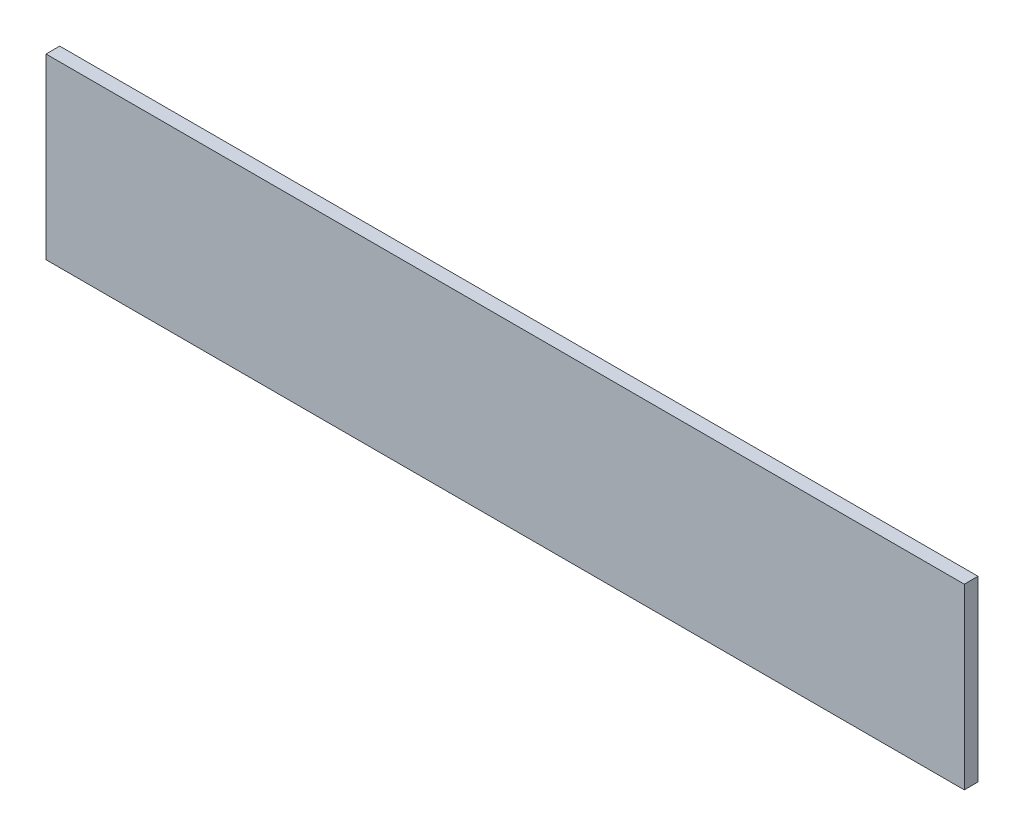
ISO-10303-21;
HEADER;
FILE_DESCRIPTION(('STEP AP214'),'2;1');
FILE_NAME('part.step','',(''),(''),'','','');
FILE_SCHEMA(('AUTOMOTIVE_DESIGN { 1 0 10303 214 1 1 1 1 }'));
ENDSEC;
DATA;
#1=APPLICATION_CONTEXT('core data for automotive mechanical design processes');
#2=APPLICATION_PROTOCOL_DEFINITION('international standard','automotive_design',2000,#1);
#3=PRODUCT_CONTEXT('',#1,'mechanical');
#4=PRODUCT('Part','Part','',(#3));
#5=PRODUCT_RELATED_PRODUCT_CATEGORY('part','',(#4));
#6=PRODUCT_DEFINITION_FORMATION('','',#4);
#7=PRODUCT_DEFINITION_CONTEXT('part definition',#1,'design');
#8=PRODUCT_DEFINITION('design','',#6,#7);
#9=PRODUCT_DEFINITION_SHAPE('','',#8);
#10=(LENGTH_UNIT() NAMED_UNIT(*) SI_UNIT(.MILLI.,.METRE.));
#11=(NAMED_UNIT(*) PLANE_ANGLE_UNIT() SI_UNIT($,.RADIAN.));
#12=(NAMED_UNIT(*) SI_UNIT($,.STERADIAN.) SOLID_ANGLE_UNIT());
#13=UNCERTAINTY_MEASURE_WITH_UNIT(LENGTH_MEASURE(1.E-05),#10,'distance_accuracy_value','');
#14=(GEOMETRIC_REPRESENTATION_CONTEXT(3) GLOBAL_UNCERTAINTY_ASSIGNED_CONTEXT((#13)) GLOBAL_UNIT_ASSIGNED_CONTEXT((#10,
#11,#12)) REPRESENTATION_CONTEXT('',''));
#15=CARTESIAN_POINT('',(0.,0.,0.));
#16=DIRECTION('',(0.,0.,1.));
#17=DIRECTION('',(1.,0.,0.));
#18=AXIS2_PLACEMENT_3D('',#15,#16,#17);
#19=CARTESIAN_POINT('',(33.5,-11.5,4.6));
#20=DIRECTION('',(1.,0.,0.));
#21=DIRECTION('',(0.,0.,-1.));
#22=AXIS2_PLACEMENT_3D('',#19,#20,#21);
#23=PLANE('',#22);
#24=DIRECTION('',(0.,-1.,0.));
#25=VECTOR('',#24,1.);
#26=CARTESIAN_POINT('',(33.5,-11.5,3.6));
#27=LINE('',#26,#25);
#28=CARTESIAN_POINT('',(33.5,-5.,3.6));
#29=VERTEX_POINT('',#28);
#30=CARTESIAN_POINT('',(33.5,-18.,3.6));
#31=VERTEX_POINT('',#30);
#32=EDGE_CURVE('E80',#29,#31,#27,.T.);
#33=ORIENTED_EDGE('',*,*,#32,.F.);
#34=DIRECTION('',(0.,0.,-1.));
#35=VECTOR('',#34,1.);
#36=CARTESIAN_POINT('',(33.5,-5.,4.6));
#37=LINE('',#36,#35);
#38=CARTESIAN_POINT('',(33.5,-5.,4.6));
#39=VERTEX_POINT('',#38);
#40=EDGE_CURVE('E11',#39,#29,#37,.T.);
#41=ORIENTED_EDGE('',*,*,#40,.F.);
#42=DIRECTION('',(0.,-1.,0.));
#43=VECTOR('',#42,1.);
#44=CARTESIAN_POINT('',(33.5,-11.5,4.6));
#45=LINE('',#44,#43);
#46=CARTESIAN_POINT('',(33.5,-18.,4.6));
#47=VERTEX_POINT('',#46);
#48=EDGE_CURVE('E65',#39,#47,#45,.T.);
#49=ORIENTED_EDGE('',*,*,#48,.T.);
#50=DIRECTION('',(0.,0.,-1.));
#51=VECTOR('',#50,1.);
#52=CARTESIAN_POINT('',(33.5,-18.,4.6));
#53=LINE('',#52,#51);
#54=EDGE_CURVE('E33',#47,#31,#53,.T.);
#55=ORIENTED_EDGE('',*,*,#54,.T.);
#56=EDGE_LOOP('',(#33,#41,#49,#55));
#57=FACE_BOUND('',#56,.T.);
#58=ADVANCED_FACE('F17',(#57),#23,.T.);
#59=CARTESIAN_POINT('',(0.,-5.,4.6));
#60=DIRECTION('',(0.,-1.,0.));
#61=DIRECTION('',(1.,0.,0.));
#62=AXIS2_PLACEMENT_3D('',#59,#60,#61);
#63=PLANE('',#62);
#64=DIRECTION('',(-1.,0.,0.));
#65=VECTOR('',#64,1.);
#66=CARTESIAN_POINT('',(0.,-5.,3.6));
#67=LINE('',#66,#65);
#68=CARTESIAN_POINT('',(-33.5,-5.,3.6));
#69=VERTEX_POINT('',#68);
#70=EDGE_CURVE('E71',#29,#69,#67,.T.);
#71=ORIENTED_EDGE('',*,*,#70,.T.);
#72=DIRECTION('',(0.,0.,-1.));
#73=VECTOR('',#72,1.);
#74=CARTESIAN_POINT('',(-33.5,-5.,4.6));
#75=LINE('',#74,#73);
#76=CARTESIAN_POINT('',(-33.5,-5.,4.6));
#77=VERTEX_POINT('',#76);
#78=EDGE_CURVE('E25',#77,#69,#75,.T.);
#79=ORIENTED_EDGE('',*,*,#78,.F.);
#80=DIRECTION('',(-1.,0.,0.));
#81=VECTOR('',#80,1.);
#82=CARTESIAN_POINT('',(0.,-5.,4.6));
#83=LINE('',#82,#81);
#84=EDGE_CURVE('E59',#39,#77,#83,.T.);
#85=ORIENTED_EDGE('',*,*,#84,.F.);
#86=ORIENTED_EDGE('',*,*,#40,.T.);
#87=EDGE_LOOP('',(#71,#79,#85,#86));
#88=FACE_BOUND('',#87,.T.);
#89=ADVANCED_FACE('F69',(#88),#63,.F.);
#90=CARTESIAN_POINT('',(-33.5,-11.5,4.6));
#91=DIRECTION('',(1.,0.,0.));
#92=DIRECTION('',(0.,0.,-1.));
#93=AXIS2_PLACEMENT_3D('',#90,#91,#92);
#94=PLANE('',#93);
#95=DIRECTION('',(0.,-1.,0.));
#96=VECTOR('',#95,1.);
#97=CARTESIAN_POINT('',(-33.5,-11.5,3.6));
#98=LINE('',#97,#96);
#99=CARTESIAN_POINT('',(-33.5,-18.,3.6));
#100=VERTEX_POINT('',#99);
#101=EDGE_CURVE('E83',#69,#100,#98,.T.);
#102=ORIENTED_EDGE('',*,*,#101,.T.);
#103=DIRECTION('',(0.,0.,-1.));
#104=VECTOR('',#103,1.);
#105=CARTESIAN_POINT('',(-33.5,-18.,4.6));
#106=LINE('',#105,#104);
#107=CARTESIAN_POINT('',(-33.5,-18.,4.6));
#108=VERTEX_POINT('',#107);
#109=EDGE_CURVE('E47',#108,#100,#106,.T.);
#110=ORIENTED_EDGE('',*,*,#109,.F.);
#111=DIRECTION('',(0.,-1.,0.));
#112=VECTOR('',#111,1.);
#113=CARTESIAN_POINT('',(-33.5,-11.5,4.6));
#114=LINE('',#113,#112);
#115=EDGE_CURVE('E64',#77,#108,#114,.T.);
#116=ORIENTED_EDGE('',*,*,#115,.F.);
#117=ORIENTED_EDGE('',*,*,#78,.T.);
#118=EDGE_LOOP('',(#102,#110,#116,#117));
#119=FACE_BOUND('',#118,.T.);
#120=ADVANCED_FACE('F74',(#119),#94,.F.);
#121=CARTESIAN_POINT('',(0.,-18.,4.6));
#122=DIRECTION('',(0.,-1.,0.));
#123=DIRECTION('',(1.,0.,0.));
#124=AXIS2_PLACEMENT_3D('',#121,#122,#123);
#125=PLANE('',#124);
#126=DIRECTION('',(-1.,0.,0.));
#127=VECTOR('',#126,1.);
#128=CARTESIAN_POINT('',(0.,-18.,3.6));
#129=LINE('',#128,#127);
#130=EDGE_CURVE('E85',#31,#100,#129,.T.);
#131=ORIENTED_EDGE('',*,*,#130,.F.);
#132=ORIENTED_EDGE('',*,*,#54,.F.);
#133=DIRECTION('',(-1.,0.,0.));
#134=VECTOR('',#133,1.);
#135=CARTESIAN_POINT('',(0.,-18.,4.6));
#136=LINE('',#135,#134);
#137=EDGE_CURVE('E75',#47,#108,#136,.T.);
#138=ORIENTED_EDGE('',*,*,#137,.T.);
#139=ORIENTED_EDGE('',*,*,#109,.T.);
#140=EDGE_LOOP('',(#131,#132,#138,#139));
#141=FACE_BOUND('',#140,.T.);
#142=ADVANCED_FACE('F90',(#141),#125,.T.);
#143=CARTESIAN_POINT('',(0.,-11.5,4.6));
#144=DIRECTION('',(0.,0.,1.));
#145=DIRECTION('',(1.,0.,0.));
#146=AXIS2_PLACEMENT_3D('',#143,#144,#145);
#147=PLANE('',#146);
#148=ORIENTED_EDGE('',*,*,#48,.F.);
#149=ORIENTED_EDGE('',*,*,#84,.T.);
#150=ORIENTED_EDGE('',*,*,#115,.T.);
#151=ORIENTED_EDGE('',*,*,#137,.F.);
#152=EDGE_LOOP('',(#148,#149,#150,#151));
#153=FACE_BOUND('',#152,.T.);
#154=ADVANCED_FACE('F61',(#153),#147,.T.);
#155=CARTESIAN_POINT('',(0.,-11.5,3.6));
#156=DIRECTION('',(0.,0.,1.));
#157=DIRECTION('',(1.,0.,0.));
#158=AXIS2_PLACEMENT_3D('',#155,#156,#157);
#159=PLANE('',#158);
#160=ORIENTED_EDGE('',*,*,#32,.T.);
#161=ORIENTED_EDGE('',*,*,#130,.T.);
#162=ORIENTED_EDGE('',*,*,#101,.F.);
#163=ORIENTED_EDGE('',*,*,#70,.F.);
#164=EDGE_LOOP('',(#160,#161,#162,#163));
#165=FACE_BOUND('',#164,.T.);
#166=ADVANCED_FACE('F98',(#165),#159,.F.);
#167=CLOSED_SHELL('',(#58,#89,#120,#142,#154,#166));
#168=MANIFOLD_SOLID_BREP('B1',#167);
#169=ADVANCED_BREP_SHAPE_REPRESENTATION('',(#18,#168),#14);
#170=SHAPE_DEFINITION_REPRESENTATION(#9,#169);
ENDSEC;
END-ISO-10303-21;
